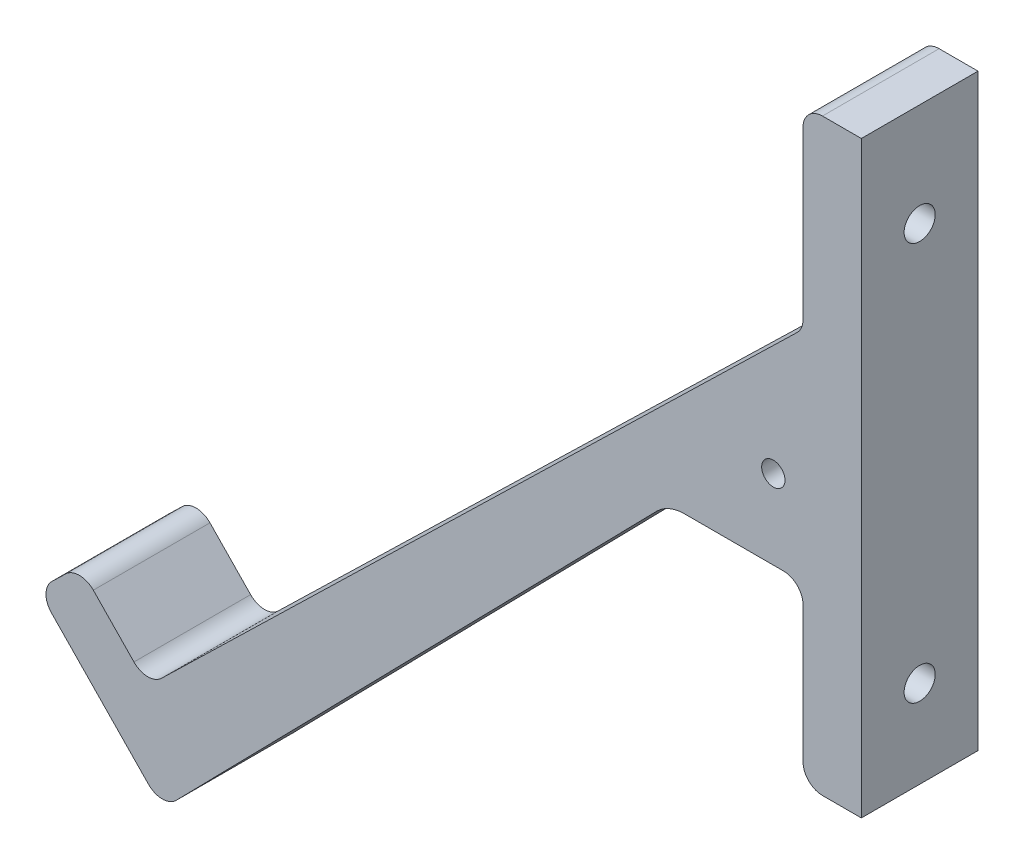
ISO-10303-21;
HEADER;
FILE_DESCRIPTION(('STEP AP214'),'2;1');
FILE_NAME('part.step','',(''),(''),'','','');
FILE_SCHEMA(('AUTOMOTIVE_DESIGN { 1 0 10303 214 1 1 1 1 }'));
ENDSEC;
DATA;
#1=APPLICATION_CONTEXT('core data for automotive mechanical design processes');
#2=APPLICATION_PROTOCOL_DEFINITION('international standard','automotive_design',2000,#1);
#3=PRODUCT_CONTEXT('',#1,'mechanical');
#4=PRODUCT('Part','Part','',(#3));
#5=PRODUCT_RELATED_PRODUCT_CATEGORY('part','',(#4));
#6=PRODUCT_DEFINITION_FORMATION('','',#4);
#7=PRODUCT_DEFINITION_CONTEXT('part definition',#1,'design');
#8=PRODUCT_DEFINITION('design','',#6,#7);
#9=PRODUCT_DEFINITION_SHAPE('','',#8);
#10=(LENGTH_UNIT() NAMED_UNIT(*) SI_UNIT(.MILLI.,.METRE.));
#11=(NAMED_UNIT(*) PLANE_ANGLE_UNIT() SI_UNIT($,.RADIAN.));
#12=(NAMED_UNIT(*) SI_UNIT($,.STERADIAN.) SOLID_ANGLE_UNIT());
#13=UNCERTAINTY_MEASURE_WITH_UNIT(LENGTH_MEASURE(1.E-05),#10,'distance_accuracy_value','');
#14=(GEOMETRIC_REPRESENTATION_CONTEXT(3) GLOBAL_UNCERTAINTY_ASSIGNED_CONTEXT((#13)) GLOBAL_UNIT_ASSIGNED_CONTEXT((#10,
#11,#12)) REPRESENTATION_CONTEXT('',''));
#15=CARTESIAN_POINT('',(0.,0.,0.));
#16=DIRECTION('',(0.,0.,1.));
#17=DIRECTION('',(1.,0.,0.));
#18=AXIS2_PLACEMENT_3D('',#15,#16,#17);
#19=CARTESIAN_POINT('',(9.99999999999997,-56.3423168679851,30.));
#20=DIRECTION('',(0.,1.,0.));
#21=DIRECTION('',(-1.,0.,0.));
#22=AXIS2_PLACEMENT_3D('',#19,#20,#21);
#23=PLANE('',#22);
#24=DIRECTION('',(1.,0.,0.));
#25=VECTOR('',#24,1.);
#26=CARTESIAN_POINT('',(9.99999999999997,-56.3423168679851,0.));
#27=LINE('',#26,#25);
#28=CARTESIAN_POINT('',(-30.4960170213361,-56.342316867985,0.));
#29=VERTEX_POINT('',#28);
#30=CARTESIAN_POINT('',(-4.99999999999998,-56.3423168679851,0.));
#31=VERTEX_POINT('',#30);
#32=EDGE_CURVE('E277',#29,#31,#27,.T.);
#33=ORIENTED_EDGE('',*,*,#32,.T.);
#34=DIRECTION('',(0.,0.,-1.));
#35=VECTOR('',#34,1.);
#36=CARTESIAN_POINT('',(-4.99999999999998,-56.3423168679851,30.));
#37=LINE('',#36,#35);
#38=CARTESIAN_POINT('',(-4.99999999999998,-56.3423168679851,30.));
#39=VERTEX_POINT('',#38);
#40=EDGE_CURVE('E59',#31,#39,#37,.F.);
#41=ORIENTED_EDGE('',*,*,#40,.T.);
#42=DIRECTION('',(1.,0.,0.));
#43=VECTOR('',#42,1.);
#44=CARTESIAN_POINT('',(9.99999999999997,-56.3423168679851,30.));
#45=LINE('',#44,#43);
#46=CARTESIAN_POINT('',(-30.4960170213361,-56.342316867985,30.));
#47=VERTEX_POINT('',#46);
#48=EDGE_CURVE('E207',#47,#39,#45,.T.);
#49=ORIENTED_EDGE('',*,*,#48,.F.);
#50=DIRECTION('',(0.,0.,-1.));
#51=VECTOR('',#50,1.);
#52=CARTESIAN_POINT('',(-30.4960170213361,-56.342316867985,30.));
#53=LINE('',#52,#51);
#54=EDGE_CURVE('E354',#47,#29,#53,.T.);
#55=ORIENTED_EDGE('',*,*,#54,.T.);
#56=EDGE_LOOP('',(#33,#41,#49,#55));
#57=FACE_BOUND('',#56,.T.);
#58=ADVANCED_FACE('F43',(#57),#23,.F.);
#59=CARTESIAN_POINT('',(-179.347269349611,-174.168185891793,30.));
#60=DIRECTION('',(0.717389077398442,0.696672743567173,0.));
#61=DIRECTION('',(-0.696672743567173,0.717389077398442,0.));
#62=AXIS2_PLACEMENT_3D('',#59,#60,#61);
#63=PLANE('',#62);
#64=DIRECTION('',(0.696672743567173,-0.717389077398442,0.));
#65=VECTOR('',#64,1.);
#66=CARTESIAN_POINT('',(-179.347269349611,-174.168185891793,0.));
#67=LINE('',#66,#65);
#68=CARTESIAN_POINT('',(-193.284026826992,-159.817003531147,0.));
#69=VERTEX_POINT('',#68);
#70=CARTESIAN_POINT('',(-168.352304294731,-185.490098381668,0.));
#71=VERTEX_POINT('',#70);
#72=EDGE_CURVE('E214',#69,#71,#67,.T.);
#73=ORIENTED_EDGE('',*,*,#72,.T.);
#74=DIRECTION('',(0.,0.,-1.));
#75=VECTOR('',#74,1.);
#76=CARTESIAN_POINT('',(-168.352304294731,-185.490098381668,30.));
#77=LINE('',#76,#75);
#78=CARTESIAN_POINT('',(-168.352304294731,-185.490098381668,30.));
#79=VERTEX_POINT('',#78);
#80=EDGE_CURVE('E366',#79,#71,#77,.T.);
#81=ORIENTED_EDGE('',*,*,#80,.F.);
#82=DIRECTION('',(0.696672743567173,-0.717389077398442,0.));
#83=VECTOR('',#82,1.);
#84=CARTESIAN_POINT('',(-179.347269349611,-174.168185891793,30.));
#85=LINE('',#84,#83);
#86=CARTESIAN_POINT('',(-193.284026826992,-159.817003531147,30.));
#87=VERTEX_POINT('',#86);
#88=EDGE_CURVE('E225',#87,#79,#85,.T.);
#89=ORIENTED_EDGE('',*,*,#88,.F.);
#90=DIRECTION('',(0.,0.,-1.));
#91=VECTOR('',#90,1.);
#92=CARTESIAN_POINT('',(-193.284026826992,-159.817003531147,30.));
#93=LINE('',#92,#91);
#94=EDGE_CURVE('E267',#87,#69,#93,.T.);
#95=ORIENTED_EDGE('',*,*,#94,.T.);
#96=EDGE_LOOP('',(#73,#81,#89,#95));
#97=FACE_BOUND('',#96,.T.);
#98=ADVANCED_FACE('F419',(#97),#63,.F.);
#99=CARTESIAN_POINT('',(-164.765358907738,-182.006734663832,30.));
#100=DIRECTION('',(0.,0.,-1.));
#101=DIRECTION('',(-1.,0.,0.));
#102=AXIS2_PLACEMENT_3D('',#99,#100,#101);
#103=CYLINDRICAL_SURFACE('',#102,5.00000000000001);
#104=CARTESIAN_POINT('',(-164.765358907738,-182.006734663832,0.));
#105=DIRECTION('',(0.,0.,1.));
#106=DIRECTION('',(1.,0.,0.));
#107=AXIS2_PLACEMENT_3D('',#104,#105,#106);
#108=CIRCLE('',#107,5.00000000000001);
#109=CARTESIAN_POINT('',(-161.193106920874,-185.505165132248,0.));
#110=VERTEX_POINT('',#109);
#111=EDGE_CURVE('E220',#71,#110,#108,.T.);
#112=ORIENTED_EDGE('',*,*,#111,.T.);
#113=DIRECTION('',(0.,0.,-1.));
#114=VECTOR('',#113,1.);
#115=CARTESIAN_POINT('',(-161.193106920874,-185.505165132248,30.));
#116=LINE('',#115,#114);
#117=CARTESIAN_POINT('',(-161.193106920874,-185.505165132248,30.));
#118=VERTEX_POINT('',#117);
#119=EDGE_CURVE('E362',#118,#110,#116,.T.);
#120=ORIENTED_EDGE('',*,*,#119,.F.);
#121=CARTESIAN_POINT('',(-164.765358907738,-182.006734663832,30.));
#122=DIRECTION('',(0.,0.,1.));
#123=DIRECTION('',(1.,0.,0.));
#124=AXIS2_PLACEMENT_3D('',#121,#122,#123);
#125=CIRCLE('',#124,5.00000000000001);
#126=EDGE_CURVE('E228',#79,#118,#125,.T.);
#127=ORIENTED_EDGE('',*,*,#126,.F.);
#128=ORIENTED_EDGE('',*,*,#80,.T.);
#129=EDGE_LOOP('',(#112,#120,#127,#128));
#130=FACE_BOUND('',#129,.T.);
#131=ADVANCED_FACE('F424',(#130),#103,.T.);
#132=CARTESIAN_POINT('',(-161.193106920874,-185.505165132248,30.));
#133=DIRECTION('',(-0.714450397372837,0.6996860936833,0.));
#134=DIRECTION('',(-0.6996860936833,-0.714450397372837,0.));
#135=AXIS2_PLACEMENT_3D('',#132,#133,#134);
#136=PLANE('',#135);
#137=DIRECTION('',(0.6996860936833,0.714450397372837,0.));
#138=VECTOR('',#137,1.);
#139=CARTESIAN_POINT('',(-161.193106920874,-185.505165132248,0.));
#140=LINE('',#139,#138);
#141=CARTESIAN_POINT('',(-37.6405209950646,-59.3454559311521,0.));
#142=VERTEX_POINT('',#141);
#143=EDGE_CURVE('E271',#110,#142,#140,.T.);
#144=ORIENTED_EDGE('',*,*,#143,.T.);
#145=DIRECTION('',(0.,0.,-1.));
#146=VECTOR('',#145,1.);
#147=CARTESIAN_POINT('',(-37.6405209950646,-59.3454559311521,30.));
#148=LINE('',#147,#146);
#149=CARTESIAN_POINT('',(-37.6405209950646,-59.3454559311521,30.));
#150=VERTEX_POINT('',#149);
#151=EDGE_CURVE('E358',#150,#142,#148,.T.);
#152=ORIENTED_EDGE('',*,*,#151,.F.);
#153=DIRECTION('',(0.6996860936833,0.714450397372837,0.));
#154=VECTOR('',#153,1.);
#155=CARTESIAN_POINT('',(-161.193106920874,-185.505165132248,30.));
#156=LINE('',#155,#154);
#157=EDGE_CURVE('E232',#118,#150,#156,.T.);
#158=ORIENTED_EDGE('',*,*,#157,.F.);
#159=ORIENTED_EDGE('',*,*,#119,.T.);
#160=EDGE_LOOP('',(#144,#152,#158,#159));
#161=FACE_BOUND('',#160,.T.);
#162=ADVANCED_FACE('F433',(#161),#136,.F.);
#163=CARTESIAN_POINT('',(-30.4960170213362,-66.342316867985,30.));
#164=DIRECTION('',(0.,0.,-1.));
#165=DIRECTION('',(-1.,0.,0.));
#166=AXIS2_PLACEMENT_3D('',#163,#164,#165);
#167=CYLINDRICAL_SURFACE('',#166,10.);
#168=CARTESIAN_POINT('',(-30.4960170213362,-66.342316867985,0.));
#169=DIRECTION('',(0.,0.,-1.));
#170=DIRECTION('',(1.,0.,0.));
#171=AXIS2_PLACEMENT_3D('',#168,#169,#170);
#172=CIRCLE('',#171,10.);
#173=EDGE_CURVE('E274',#142,#29,#172,.T.);
#174=ORIENTED_EDGE('',*,*,#173,.T.);
#175=ORIENTED_EDGE('',*,*,#54,.F.);
#176=CARTESIAN_POINT('',(-30.4960170213362,-66.342316867985,30.));
#177=DIRECTION('',(0.,0.,-1.));
#178=DIRECTION('',(1.,0.,0.));
#179=AXIS2_PLACEMENT_3D('',#176,#177,#178);
#180=CIRCLE('',#179,10.);
#181=EDGE_CURVE('E235',#150,#47,#180,.T.);
#182=ORIENTED_EDGE('',*,*,#181,.F.);
#183=ORIENTED_EDGE('',*,*,#151,.T.);
#184=EDGE_LOOP('',(#174,#175,#182,#183));
#185=FACE_BOUND('',#184,.T.);
#186=ADVANCED_FACE('F430',(#185),#167,.F.);
#187=CARTESIAN_POINT('',(15.,50.,30.));
#188=DIRECTION('',(-1.,0.,0.));
#189=DIRECTION('',(0.,0.,1.));
#190=AXIS2_PLACEMENT_3D('',#187,#188,#189);
#191=PLANE('',#190);
#192=CARTESIAN_POINT('',(15.,-78.842316867985,15.));
#193=DIRECTION('',(-1.,0.,0.));
#194=DIRECTION('',(0.,0.,1.));
#195=AXIS2_PLACEMENT_3D('',#192,#193,#194);
#196=CIRCLE('',#195,4.);
#197=CARTESIAN_POINT('',(15.,-78.842316867985,19.));
#198=VERTEX_POINT('',#197);
#199=EDGE_CURVE('E471',#198,#198,#196,.T.);
#200=ORIENTED_EDGE('',*,*,#199,.T.);
#201=EDGE_LOOP('',(#200));
#202=FACE_BOUND('',#201,.T.);
#203=CARTESIAN_POINT('',(15.,23.5570528113308,15.));
#204=DIRECTION('',(-1.,0.,0.));
#205=DIRECTION('',(0.,0.,1.));
#206=AXIS2_PLACEMENT_3D('',#203,#204,#205);
#207=CIRCLE('',#206,4.);
#208=CARTESIAN_POINT('',(15.,23.5570528113308,19.));
#209=VERTEX_POINT('',#208);
#210=EDGE_CURVE('E464',#209,#209,#207,.T.);
#211=ORIENTED_EDGE('',*,*,#210,.T.);
#212=EDGE_LOOP('',(#211));
#213=FACE_BOUND('',#212,.T.);
#214=DIRECTION('',(0.,1.,0.));
#215=VECTOR('',#214,1.);
#216=CARTESIAN_POINT('',(15.,50.,0.));
#217=LINE('',#216,#215);
#218=CARTESIAN_POINT('',(15.,-101.342316867985,0.));
#219=VERTEX_POINT('',#218);
#220=CARTESIAN_POINT('',(15.,50.,0.));
#221=VERTEX_POINT('',#220);
#222=EDGE_CURVE('E280',#219,#221,#217,.T.);
#223=ORIENTED_EDGE('',*,*,#222,.T.);
#224=DIRECTION('',(0.,0.,-1.));
#225=VECTOR('',#224,1.);
#226=CARTESIAN_POINT('',(15.,50.,30.));
#227=LINE('',#226,#225);
#228=CARTESIAN_POINT('',(15.,50.,30.));
#229=VERTEX_POINT('',#228);
#230=EDGE_CURVE('E203',#229,#221,#227,.T.);
#231=ORIENTED_EDGE('',*,*,#230,.F.);
#232=DIRECTION('',(0.,1.,0.));
#233=VECTOR('',#232,1.);
#234=CARTESIAN_POINT('',(15.,-6.34231686798508,30.));
#235=LINE('',#234,#233);
#236=CARTESIAN_POINT('',(15.,-101.342316867985,30.));
#237=VERTEX_POINT('',#236);
#238=EDGE_CURVE('E187',#237,#229,#235,.T.);
#239=ORIENTED_EDGE('',*,*,#238,.F.);
#240=DIRECTION('',(0.,0.,-1.));
#241=VECTOR('',#240,1.);
#242=CARTESIAN_POINT('',(15.,-101.342316867985,30.));
#243=LINE('',#242,#241);
#244=EDGE_CURVE('E196',#237,#219,#243,.T.);
#245=ORIENTED_EDGE('',*,*,#244,.T.);
#246=EDGE_LOOP('',(#223,#231,#239,#245));
#247=FACE_BOUND('',#246,.T.);
#248=ADVANCED_FACE('F201',(#202,#213,#247),#191,.F.);
#249=CARTESIAN_POINT('',(5.00000000000004,50.,30.));
#250=DIRECTION('',(0.,-1.,0.));
#251=DIRECTION('',(0.,0.,-1.));
#252=AXIS2_PLACEMENT_3D('',#249,#250,#251);
#253=PLANE('',#252);
#254=DIRECTION('',(-1.,0.,0.));
#255=VECTOR('',#254,1.);
#256=CARTESIAN_POINT('',(5.00000000000004,50.,0.));
#257=LINE('',#256,#255);
#258=CARTESIAN_POINT('',(5.00000000000004,50.,0.));
#259=VERTEX_POINT('',#258);
#260=EDGE_CURVE('E283',#221,#259,#257,.T.);
#261=ORIENTED_EDGE('',*,*,#260,.T.);
#262=DIRECTION('',(0.,0.,-1.));
#263=VECTOR('',#262,1.);
#264=CARTESIAN_POINT('',(5.00000000000004,50.,30.));
#265=LINE('',#264,#263);
#266=CARTESIAN_POINT('',(5.00000000000004,50.,30.));
#267=VERTEX_POINT('',#266);
#268=EDGE_CURVE('E348',#267,#259,#265,.T.);
#269=ORIENTED_EDGE('',*,*,#268,.F.);
#270=DIRECTION('',(-1.,0.,0.));
#271=VECTOR('',#270,1.);
#272=CARTESIAN_POINT('',(5.00000000000004,50.,30.));
#273=LINE('',#272,#271);
#274=EDGE_CURVE('E206',#229,#267,#273,.T.);
#275=ORIENTED_EDGE('',*,*,#274,.F.);
#276=ORIENTED_EDGE('',*,*,#230,.T.);
#277=EDGE_LOOP('',(#261,#269,#275,#276));
#278=FACE_BOUND('',#277,.T.);
#279=ADVANCED_FACE('F536',(#278),#253,.F.);
#280=CARTESIAN_POINT('',(5.,45.,30.));
#281=DIRECTION('',(0.,0.,-1.));
#282=DIRECTION('',(-1.,0.,0.));
#283=AXIS2_PLACEMENT_3D('',#280,#281,#282);
#284=CYLINDRICAL_SURFACE('',#283,5.);
#285=CARTESIAN_POINT('',(5.,45.,0.));
#286=DIRECTION('',(0.,0.,1.));
#287=DIRECTION('',(-1.,0.,0.));
#288=AXIS2_PLACEMENT_3D('',#285,#286,#287);
#289=CIRCLE('',#288,5.);
#290=CARTESIAN_POINT('',(0.,45.,0.));
#291=VERTEX_POINT('',#290);
#292=EDGE_CURVE('E286',#259,#291,#289,.T.);
#293=ORIENTED_EDGE('',*,*,#292,.T.);
#294=DIRECTION('',(0.,0.,-1.));
#295=VECTOR('',#294,1.);
#296=CARTESIAN_POINT('',(0.,45.,30.));
#297=LINE('',#296,#295);
#298=CARTESIAN_POINT('',(0.,45.,30.));
#299=VERTEX_POINT('',#298);
#300=EDGE_CURVE('E344',#299,#291,#297,.T.);
#301=ORIENTED_EDGE('',*,*,#300,.F.);
#302=CARTESIAN_POINT('',(5.,45.,30.));
#303=DIRECTION('',(0.,0.,1.));
#304=DIRECTION('',(-1.,0.,0.));
#305=AXIS2_PLACEMENT_3D('',#302,#303,#304);
#306=CIRCLE('',#305,5.);
#307=EDGE_CURVE('E242',#267,#299,#306,.T.);
#308=ORIENTED_EDGE('',*,*,#307,.F.);
#309=ORIENTED_EDGE('',*,*,#268,.T.);
#310=EDGE_LOOP('',(#293,#301,#308,#309));
#311=FACE_BOUND('',#310,.T.);
#312=ADVANCED_FACE('F533',(#311),#284,.T.);
#313=CARTESIAN_POINT('',(0.,2.11410562266172,30.));
#314=DIRECTION('',(1.,0.,0.));
#315=DIRECTION('',(0.,0.,-1.));
#316=AXIS2_PLACEMENT_3D('',#313,#314,#315);
#317=PLANE('',#316);
#318=CARTESIAN_POINT('',(0.,23.5570528113308,15.));
#319=DIRECTION('',(1.,0.,0.));
#320=DIRECTION('',(0.,0.,-1.));
#321=AXIS2_PLACEMENT_3D('',#318,#319,#320);
#322=CIRCLE('',#321,4.5);
#323=CARTESIAN_POINT('',(0.,23.5570528113308,10.5));
#324=VERTEX_POINT('',#323);
#325=EDGE_CURVE('E395',#324,#324,#322,.T.);
#326=ORIENTED_EDGE('',*,*,#325,.T.);
#327=EDGE_LOOP('',(#326));
#328=FACE_BOUND('',#327,.T.);
#329=DIRECTION('',(0.,-1.,0.));
#330=VECTOR('',#329,1.);
#331=CARTESIAN_POINT('',(0.,2.11410562266172,0.));
#332=LINE('',#331,#330);
#333=CARTESIAN_POINT('',(0.,2.11410562266172,0.));
#334=VERTEX_POINT('',#333);
#335=EDGE_CURVE('E289',#291,#334,#332,.T.);
#336=ORIENTED_EDGE('',*,*,#335,.T.);
#337=DIRECTION('',(0.,0.,-1.));
#338=VECTOR('',#337,1.);
#339=CARTESIAN_POINT('',(0.,2.11410562266172,30.));
#340=LINE('',#339,#338);
#341=CARTESIAN_POINT('',(0.,2.11410562266172,30.));
#342=VERTEX_POINT('',#341);
#343=EDGE_CURVE('E340',#342,#334,#340,.T.);
#344=ORIENTED_EDGE('',*,*,#343,.F.);
#345=DIRECTION('',(0.,-1.,0.));
#346=VECTOR('',#345,1.);
#347=CARTESIAN_POINT('',(0.,2.11410562266172,30.));
#348=LINE('',#347,#346);
#349=EDGE_CURVE('E245',#299,#342,#348,.T.);
#350=ORIENTED_EDGE('',*,*,#349,.F.);
#351=ORIENTED_EDGE('',*,*,#300,.T.);
#352=EDGE_LOOP('',(#336,#344,#350,#351));
#353=FACE_BOUND('',#352,.T.);
#354=ADVANCED_FACE('F529',(#328,#353),#317,.F.);
#355=CARTESIAN_POINT('',(-5.,2.1141056226617,30.));
#356=DIRECTION('',(0.,0.,-1.));
#357=DIRECTION('',(-1.,0.,0.));
#358=AXIS2_PLACEMENT_3D('',#355,#356,#357);
#359=CYLINDRICAL_SURFACE('',#358,5.);
#360=CARTESIAN_POINT('',(-5.,2.1141056226617,0.));
#361=DIRECTION('',(0.,0.,-1.));
#362=DIRECTION('',(1.,0.,0.));
#363=AXIS2_PLACEMENT_3D('',#360,#361,#362);
#364=CIRCLE('',#363,5.);
#365=CARTESIAN_POINT('',(-1.51663628216415,-1.47283976433053,0.));
#366=VERTEX_POINT('',#365);
#367=EDGE_CURVE('E292',#334,#366,#364,.T.);
#368=ORIENTED_EDGE('',*,*,#367,.T.);
#369=DIRECTION('',(0.,0.,-1.));
#370=VECTOR('',#369,1.);
#371=CARTESIAN_POINT('',(-1.51663628216415,-1.47283976433053,30.));
#372=LINE('',#371,#370);
#373=CARTESIAN_POINT('',(-1.51663628216415,-1.47283976433053,30.));
#374=VERTEX_POINT('',#373);
#375=EDGE_CURVE('E336',#374,#366,#372,.T.);
#376=ORIENTED_EDGE('',*,*,#375,.F.);
#377=CARTESIAN_POINT('',(-5.,2.1141056226617,30.));
#378=DIRECTION('',(0.,0.,-1.));
#379=DIRECTION('',(1.,0.,0.));
#380=AXIS2_PLACEMENT_3D('',#377,#378,#379);
#381=CIRCLE('',#380,5.);
#382=EDGE_CURVE('E248',#342,#374,#381,.T.);
#383=ORIENTED_EDGE('',*,*,#382,.F.);
#384=ORIENTED_EDGE('',*,*,#343,.T.);
#385=EDGE_LOOP('',(#368,#376,#383,#384));
#386=FACE_BOUND('',#385,.T.);
#387=ADVANCED_FACE('F525',(#386),#359,.F.);
#388=CARTESIAN_POINT('',(-1.51663628216415,-1.47283976433053,30.));
#389=DIRECTION('',(0.696672743567173,-0.717389077398442,0.));
#390=DIRECTION('',(0.717389077398442,0.696672743567173,0.));
#391=AXIS2_PLACEMENT_3D('',#388,#389,#390);
#392=PLANE('',#391);
#393=DIRECTION('',(-0.717389077398442,-0.696672743567173,0.));
#394=VECTOR('',#393,1.);
#395=CARTESIAN_POINT('',(-1.51663628216415,-1.47283976433053,0.));
#396=LINE('',#395,#394);
#397=CARTESIAN_POINT('',(-164.999487801642,-160.23473102045,0.));
#398=VERTEX_POINT('',#397);
#399=EDGE_CURVE('E295',#366,#398,#396,.T.);
#400=ORIENTED_EDGE('',*,*,#399,.T.);
#401=DIRECTION('',(0.,0.,-1.));
#402=VECTOR('',#401,1.);
#403=CARTESIAN_POINT('',(-164.999487801642,-160.23473102045,30.));
#404=LINE('',#403,#402);
#405=CARTESIAN_POINT('',(-164.999487801642,-160.23473102045,30.));
#406=VERTEX_POINT('',#405);
#407=EDGE_CURVE('E332',#406,#398,#404,.T.);
#408=ORIENTED_EDGE('',*,*,#407,.F.);
#409=DIRECTION('',(-0.717389077398442,-0.696672743567173,0.));
#410=VECTOR('',#409,1.);
#411=CARTESIAN_POINT('',(-1.51663628216415,-1.47283976433053,30.));
#412=LINE('',#411,#410);
#413=EDGE_CURVE('E250',#374,#406,#412,.T.);
#414=ORIENTED_EDGE('',*,*,#413,.F.);
#415=ORIENTED_EDGE('',*,*,#375,.T.);
#416=EDGE_LOOP('',(#400,#408,#414,#415));
#417=FACE_BOUND('',#416,.T.);
#418=ADVANCED_FACE('F521',(#417),#392,.F.);
#419=CARTESIAN_POINT('',(-168.482851519477,-156.647785633458,30.));
#420=DIRECTION('',(0.,0.,-1.));
#421=DIRECTION('',(-1.,0.,0.));
#422=AXIS2_PLACEMENT_3D('',#419,#420,#421);
#423=CYLINDRICAL_SURFACE('',#422,5.);
#424=CARTESIAN_POINT('',(-168.482851519477,-156.647785633458,0.));
#425=DIRECTION('',(0.,0.,-1.));
#426=DIRECTION('',(1.,0.,0.));
#427=AXIS2_PLACEMENT_3D('',#424,#425,#426);
#428=CIRCLE('',#427,5.);
#429=CARTESIAN_POINT('',(-172.06979690647,-160.131149351293,0.));
#430=VERTEX_POINT('',#429);
#431=EDGE_CURVE('E298',#398,#430,#428,.T.);
#432=ORIENTED_EDGE('',*,*,#431,.T.);
#433=DIRECTION('',(0.,0.,-1.));
#434=VECTOR('',#433,1.);
#435=CARTESIAN_POINT('',(-172.06979690647,-160.131149351293,30.));
#436=LINE('',#435,#434);
#437=CARTESIAN_POINT('',(-172.06979690647,-160.131149351293,30.));
#438=VERTEX_POINT('',#437);
#439=EDGE_CURVE('E328',#438,#430,#436,.T.);
#440=ORIENTED_EDGE('',*,*,#439,.F.);
#441=CARTESIAN_POINT('',(-168.482851519477,-156.647785633458,30.));
#442=DIRECTION('',(0.,0.,-1.));
#443=DIRECTION('',(1.,0.,0.));
#444=AXIS2_PLACEMENT_3D('',#441,#442,#443);
#445=CIRCLE('',#444,5.);
#446=EDGE_CURVE('E253',#406,#438,#445,.T.);
#447=ORIENTED_EDGE('',*,*,#446,.F.);
#448=ORIENTED_EDGE('',*,*,#407,.T.);
#449=EDGE_LOOP('',(#432,#440,#447,#448));
#450=FACE_BOUND('',#449,.T.);
#451=ADVANCED_FACE('F517',(#450),#423,.F.);
#452=CARTESIAN_POINT('',(-182.523190666015,-149.366912377639,30.));
#453=DIRECTION('',(-0.717389077398442,-0.696672743567173,0.));
#454=DIRECTION('',(0.696672743567173,-0.717389077398442,0.));
#455=AXIS2_PLACEMENT_3D('',#452,#453,#454);
#456=PLANE('',#455);
#457=DIRECTION('',(-0.696672743567173,0.717389077398442,0.));
#458=VECTOR('',#457,1.);
#459=CARTESIAN_POINT('',(-182.523190666015,-149.366912377639,0.));
#460=LINE('',#459,#458);
#461=CARTESIAN_POINT('',(-182.523190666015,-149.366912377639,0.));
#462=VERTEX_POINT('',#461);
#463=EDGE_CURVE('E301',#430,#462,#460,.T.);
#464=ORIENTED_EDGE('',*,*,#463,.T.);
#465=DIRECTION('',(0.,0.,-1.));
#466=VECTOR('',#465,1.);
#467=CARTESIAN_POINT('',(-182.523190666015,-149.366912377639,30.));
#468=LINE('',#467,#466);
#469=CARTESIAN_POINT('',(-182.523190666015,-149.366912377639,30.));
#470=VERTEX_POINT('',#469);
#471=EDGE_CURVE('E324',#470,#462,#468,.T.);
#472=ORIENTED_EDGE('',*,*,#471,.F.);
#473=DIRECTION('',(-0.696672743567173,0.717389077398442,0.));
#474=VECTOR('',#473,1.);
#475=CARTESIAN_POINT('',(-182.523190666015,-149.366912377639,30.));
#476=LINE('',#475,#474);
#477=EDGE_CURVE('E256',#438,#470,#476,.T.);
#478=ORIENTED_EDGE('',*,*,#477,.F.);
#479=ORIENTED_EDGE('',*,*,#439,.T.);
#480=EDGE_LOOP('',(#464,#472,#478,#479));
#481=FACE_BOUND('',#480,.T.);
#482=ADVANCED_FACE('F513',(#481),#456,.F.);
#483=CARTESIAN_POINT('',(-186.110136053007,-152.850276095475,30.));
#484=DIRECTION('',(0.,0.,-1.));
#485=DIRECTION('',(-1.,0.,0.));
#486=AXIS2_PLACEMENT_3D('',#483,#484,#485);
#487=CYLINDRICAL_SURFACE('',#486,5.00000000000003);
#488=CARTESIAN_POINT('',(-186.110136053007,-152.850276095475,0.));
#489=DIRECTION('',(0.,0.,1.));
#490=DIRECTION('',(-1.,0.,0.));
#491=AXIS2_PLACEMENT_3D('',#488,#489,#490);
#492=CIRCLE('',#491,5.00000000000003);
#493=CARTESIAN_POINT('',(-189.593499770843,-149.263330708483,0.));
#494=VERTEX_POINT('',#493);
#495=EDGE_CURVE('E304',#462,#494,#492,.T.);
#496=ORIENTED_EDGE('',*,*,#495,.T.);
#497=DIRECTION('',(0.,0.,-1.));
#498=VECTOR('',#497,1.);
#499=CARTESIAN_POINT('',(-189.593499770843,-149.263330708483,30.));
#500=LINE('',#499,#498);
#501=CARTESIAN_POINT('',(-189.593499770843,-149.263330708483,30.));
#502=VERTEX_POINT('',#501);
#503=EDGE_CURVE('E320',#502,#494,#500,.T.);
#504=ORIENTED_EDGE('',*,*,#503,.F.);
#505=CARTESIAN_POINT('',(-186.110136053007,-152.850276095475,30.));
#506=DIRECTION('',(0.,0.,1.));
#507=DIRECTION('',(-1.,0.,0.));
#508=AXIS2_PLACEMENT_3D('',#505,#506,#507);
#509=CIRCLE('',#508,5.00000000000003);
#510=EDGE_CURVE('E259',#470,#502,#509,.T.);
#511=ORIENTED_EDGE('',*,*,#510,.F.);
#512=ORIENTED_EDGE('',*,*,#471,.T.);
#513=EDGE_LOOP('',(#496,#504,#511,#512));
#514=FACE_BOUND('',#513,.T.);
#515=ADVANCED_FACE('F509',(#514),#487,.T.);
#516=CARTESIAN_POINT('',(-193.180445157835,-152.746694426319,30.));
#517=DIRECTION('',(0.696672743567174,-0.717389077398441,0.));
#518=DIRECTION('',(0.717389077398441,0.696672743567174,0.));
#519=AXIS2_PLACEMENT_3D('',#516,#517,#518);
#520=PLANE('',#519);
#521=DIRECTION('',(-0.717389077398441,-0.696672743567174,0.));
#522=VECTOR('',#521,1.);
#523=CARTESIAN_POINT('',(-193.180445157835,-152.746694426319,0.));
#524=LINE('',#523,#522);
#525=CARTESIAN_POINT('',(-193.180445157835,-152.746694426319,0.));
#526=VERTEX_POINT('',#525);
#527=EDGE_CURVE('E307',#494,#526,#524,.T.);
#528=ORIENTED_EDGE('',*,*,#527,.T.);
#529=DIRECTION('',(0.,0.,-1.));
#530=VECTOR('',#529,1.);
#531=CARTESIAN_POINT('',(-193.180445157835,-152.746694426319,30.));
#532=LINE('',#531,#530);
#533=CARTESIAN_POINT('',(-193.180445157835,-152.746694426319,30.));
#534=VERTEX_POINT('',#533);
#535=EDGE_CURVE('E316',#534,#526,#532,.T.);
#536=ORIENTED_EDGE('',*,*,#535,.F.);
#537=DIRECTION('',(-0.717389077398441,-0.696672743567174,0.));
#538=VECTOR('',#537,1.);
#539=CARTESIAN_POINT('',(-193.180445157835,-152.746694426319,30.));
#540=LINE('',#539,#538);
#541=EDGE_CURVE('E262',#502,#534,#540,.T.);
#542=ORIENTED_EDGE('',*,*,#541,.F.);
#543=ORIENTED_EDGE('',*,*,#503,.T.);
#544=EDGE_LOOP('',(#528,#536,#542,#543));
#545=FACE_BOUND('',#544,.T.);
#546=ADVANCED_FACE('F501',(#545),#520,.F.);
#547=CARTESIAN_POINT('',(-189.69708144,-156.333639813311,30.));
#548=DIRECTION('',(0.,0.,-1.));
#549=DIRECTION('',(-1.,0.,0.));
#550=AXIS2_PLACEMENT_3D('',#547,#548,#549);
#551=CYLINDRICAL_SURFACE('',#550,5.00000000000002);
#552=CARTESIAN_POINT('',(-189.69708144,-156.333639813311,0.));
#553=DIRECTION('',(0.,0.,1.));
#554=DIRECTION('',(-1.,0.,0.));
#555=AXIS2_PLACEMENT_3D('',#552,#553,#554);
#556=CIRCLE('',#555,5.00000000000002);
#557=EDGE_CURVE('E229',#526,#69,#556,.T.);
#558=ORIENTED_EDGE('',*,*,#557,.T.);
#559=ORIENTED_EDGE('',*,*,#94,.F.);
#560=CARTESIAN_POINT('',(-189.69708144,-156.333639813311,30.));
#561=DIRECTION('',(0.,0.,1.));
#562=DIRECTION('',(-1.,0.,0.));
#563=AXIS2_PLACEMENT_3D('',#560,#561,#562);
#564=CIRCLE('',#563,5.00000000000002);
#565=EDGE_CURVE('E265',#534,#87,#564,.T.);
#566=ORIENTED_EDGE('',*,*,#565,.F.);
#567=ORIENTED_EDGE('',*,*,#535,.T.);
#568=EDGE_LOOP('',(#558,#559,#566,#567));
#569=FACE_BOUND('',#568,.T.);
#570=ADVANCED_FACE('F493',(#569),#551,.T.);
#571=CARTESIAN_POINT('',(-189.69708144,-156.333639813311,30.));
#572=DIRECTION('',(0.,0.,-1.));
#573=DIRECTION('',(-1.,0.,0.));
#574=AXIS2_PLACEMENT_3D('',#571,#572,#573);
#575=PLANE('',#574);
#576=CARTESIAN_POINT('',(-7.63717374163167,-35.9568868399907,30.));
#577=DIRECTION('',(0.,0.,1.));
#578=DIRECTION('',(1.,0.,0.));
#579=AXIS2_PLACEMENT_3D('',#576,#577,#578);
#580=CIRCLE('',#579,3.);
#581=CARTESIAN_POINT('',(-4.63717374163167,-35.9568868399907,30.));
#582=VERTEX_POINT('',#581);
#583=EDGE_CURVE('E482',#582,#582,#580,.T.);
#584=ORIENTED_EDGE('',*,*,#583,.F.);
#585=EDGE_LOOP('',(#584));
#586=FACE_BOUND('',#585,.T.);
#587=DIRECTION('',(0.,-1.,0.));
#588=VECTOR('',#587,1.);
#589=CARTESIAN_POINT('',(0.,-51.342316867985,30.));
#590=LINE('',#589,#588);
#591=CARTESIAN_POINT('',(0.,-61.3423168679851,30.));
#592=VERTEX_POINT('',#591);
#593=CARTESIAN_POINT('',(0.,-96.342316867985,30.));
#594=VERTEX_POINT('',#593);
#595=EDGE_CURVE('E197',#592,#594,#590,.T.);
#596=ORIENTED_EDGE('',*,*,#595,.T.);
#597=CARTESIAN_POINT('',(5.00000000000002,-96.342316867985,30.));
#598=DIRECTION('',(0.,0.,-1.));
#599=DIRECTION('',(-1.,0.,0.));
#600=AXIS2_PLACEMENT_3D('',#597,#598,#599);
#601=CIRCLE('',#600,5.);
#602=CARTESIAN_POINT('',(5.00000000000002,-101.342316867985,30.));
#603=VERTEX_POINT('',#602);
#604=EDGE_CURVE('E190',#594,#603,#601,.F.);
#605=ORIENTED_EDGE('',*,*,#604,.T.);
#606=DIRECTION('',(1.,0.,0.));
#607=VECTOR('',#606,1.);
#608=CARTESIAN_POINT('',(15.,-101.342316867985,30.));
#609=LINE('',#608,#607);
#610=EDGE_CURVE('E184',#603,#237,#609,.T.);
#611=ORIENTED_EDGE('',*,*,#610,.T.);
#612=ORIENTED_EDGE('',*,*,#238,.T.);
#613=ORIENTED_EDGE('',*,*,#274,.T.);
#614=ORIENTED_EDGE('',*,*,#307,.T.);
#615=ORIENTED_EDGE('',*,*,#349,.T.);
#616=ORIENTED_EDGE('',*,*,#382,.T.);
#617=ORIENTED_EDGE('',*,*,#413,.T.);
#618=ORIENTED_EDGE('',*,*,#446,.T.);
#619=ORIENTED_EDGE('',*,*,#477,.T.);
#620=ORIENTED_EDGE('',*,*,#510,.T.);
#621=ORIENTED_EDGE('',*,*,#541,.T.);
#622=ORIENTED_EDGE('',*,*,#565,.T.);
#623=ORIENTED_EDGE('',*,*,#88,.T.);
#624=ORIENTED_EDGE('',*,*,#126,.T.);
#625=ORIENTED_EDGE('',*,*,#157,.T.);
#626=ORIENTED_EDGE('',*,*,#181,.T.);
#627=ORIENTED_EDGE('',*,*,#48,.T.);
#628=CARTESIAN_POINT('',(-4.99999999999999,-61.3423168679851,30.));
#629=DIRECTION('',(0.,0.,-1.));
#630=DIRECTION('',(-1.,0.,0.));
#631=AXIS2_PLACEMENT_3D('',#628,#629,#630);
#632=CIRCLE('',#631,5.);
#633=EDGE_CURVE('E388',#39,#592,#632,.T.);
#634=ORIENTED_EDGE('',*,*,#633,.T.);
#635=EDGE_LOOP('',(#596,#605,#611,#612,#613,#614,#615,#616,#617,#618,#619,#620,#621,#622,#623,
#624,#625,#626,#627,#634));
#636=FACE_BOUND('',#635,.T.);
#637=ADVANCED_FACE('F186',(#586,#636),#575,.F.);
#638=CARTESIAN_POINT('',(-189.69708144,-156.333639813311,0.));
#639=DIRECTION('',(0.,0.,-1.));
#640=DIRECTION('',(-1.,0.,0.));
#641=AXIS2_PLACEMENT_3D('',#638,#639,#640);
#642=PLANE('',#641);
#643=CARTESIAN_POINT('',(-7.63717374163167,-35.9568868399907,0.));
#644=DIRECTION('',(0.,0.,1.));
#645=DIRECTION('',(1.,0.,0.));
#646=AXIS2_PLACEMENT_3D('',#643,#644,#645);
#647=CIRCLE('',#646,3.);
#648=CARTESIAN_POINT('',(-4.63717374163167,-35.9568868399907,0.));
#649=VERTEX_POINT('',#648);
#650=EDGE_CURVE('E477',#649,#649,#647,.T.);
#651=ORIENTED_EDGE('',*,*,#650,.T.);
#652=EDGE_LOOP('',(#651));
#653=FACE_BOUND('',#652,.T.);
#654=DIRECTION('',(1.,0.,0.));
#655=VECTOR('',#654,1.);
#656=CARTESIAN_POINT('',(15.,-101.342316867985,0.));
#657=LINE('',#656,#655);
#658=CARTESIAN_POINT('',(5.00000000000002,-101.342316867985,0.));
#659=VERTEX_POINT('',#658);
#660=EDGE_CURVE('E211',#659,#219,#657,.T.);
#661=ORIENTED_EDGE('',*,*,#660,.F.);
#662=CARTESIAN_POINT('',(5.00000000000002,-96.342316867985,0.));
#663=DIRECTION('',(0.,0.,-1.));
#664=DIRECTION('',(-1.,0.,0.));
#665=AXIS2_PLACEMENT_3D('',#662,#663,#664);
#666=CIRCLE('',#665,5.);
#667=CARTESIAN_POINT('',(0.,-96.342316867985,0.));
#668=VERTEX_POINT('',#667);
#669=EDGE_CURVE('E372',#659,#668,#666,.T.);
#670=ORIENTED_EDGE('',*,*,#669,.T.);
#671=DIRECTION('',(0.,-1.,0.));
#672=VECTOR('',#671,1.);
#673=CARTESIAN_POINT('',(0.,-51.342316867985,0.));
#674=LINE('',#673,#672);
#675=CARTESIAN_POINT('',(0.,-61.3423168679851,0.));
#676=VERTEX_POINT('',#675);
#677=EDGE_CURVE('E462',#676,#668,#674,.T.);
#678=ORIENTED_EDGE('',*,*,#677,.F.);
#679=CARTESIAN_POINT('',(-4.99999999999999,-61.3423168679851,0.));
#680=DIRECTION('',(0.,0.,-1.));
#681=DIRECTION('',(-1.,0.,0.));
#682=AXIS2_PLACEMENT_3D('',#679,#680,#681);
#683=CIRCLE('',#682,5.);
#684=EDGE_CURVE('E385',#676,#31,#683,.F.);
#685=ORIENTED_EDGE('',*,*,#684,.T.);
#686=ORIENTED_EDGE('',*,*,#32,.F.);
#687=ORIENTED_EDGE('',*,*,#173,.F.);
#688=ORIENTED_EDGE('',*,*,#143,.F.);
#689=ORIENTED_EDGE('',*,*,#111,.F.);
#690=ORIENTED_EDGE('',*,*,#72,.F.);
#691=ORIENTED_EDGE('',*,*,#557,.F.);
#692=ORIENTED_EDGE('',*,*,#527,.F.);
#693=ORIENTED_EDGE('',*,*,#495,.F.);
#694=ORIENTED_EDGE('',*,*,#463,.F.);
#695=ORIENTED_EDGE('',*,*,#431,.F.);
#696=ORIENTED_EDGE('',*,*,#399,.F.);
#697=ORIENTED_EDGE('',*,*,#367,.F.);
#698=ORIENTED_EDGE('',*,*,#335,.F.);
#699=ORIENTED_EDGE('',*,*,#292,.F.);
#700=ORIENTED_EDGE('',*,*,#260,.F.);
#701=ORIENTED_EDGE('',*,*,#222,.F.);
#702=EDGE_LOOP('',(#661,#670,#678,#685,#686,#687,#688,#689,#690,#691,#692,#693,#694,#695,#696,
#697,#698,#699,#700,#701));
#703=FACE_BOUND('',#702,.T.);
#704=ADVANCED_FACE('F492',(#653,#703),#642,.T.);
#705=CARTESIAN_POINT('',(0.,-51.342316867985,30.));
#706=DIRECTION('',(1.,0.,0.));
#707=DIRECTION('',(0.,1.,0.));
#708=AXIS2_PLACEMENT_3D('',#705,#706,#707);
#709=PLANE('',#708);
#710=CARTESIAN_POINT('',(0.,-78.842316867985,15.));
#711=DIRECTION('',(1.,0.,0.));
#712=DIRECTION('',(0.,1.,0.));
#713=AXIS2_PLACEMENT_3D('',#710,#711,#712);
#714=CIRCLE('',#713,4.5);
#715=CARTESIAN_POINT('',(0.,-74.342316867985,15.));
#716=VERTEX_POINT('',#715);
#717=EDGE_CURVE('E11',#716,#716,#714,.T.);
#718=ORIENTED_EDGE('',*,*,#717,.T.);
#719=EDGE_LOOP('',(#718));
#720=FACE_BOUND('',#719,.T.);
#721=ORIENTED_EDGE('',*,*,#677,.T.);
#722=DIRECTION('',(0.,0.,-1.));
#723=VECTOR('',#722,1.);
#724=CARTESIAN_POINT('',(0.,-96.342316867985,30.));
#725=LINE('',#724,#723);
#726=EDGE_CURVE('E67',#668,#594,#725,.F.);
#727=ORIENTED_EDGE('',*,*,#726,.T.);
#728=ORIENTED_EDGE('',*,*,#595,.F.);
#729=DIRECTION('',(0.,0.,-1.));
#730=VECTOR('',#729,1.);
#731=CARTESIAN_POINT('',(0.,-61.3423168679851,0.));
#732=LINE('',#731,#730);
#733=EDGE_CURVE('E375',#592,#676,#732,.T.);
#734=ORIENTED_EDGE('',*,*,#733,.T.);
#735=EDGE_LOOP('',(#721,#727,#728,#734));
#736=FACE_BOUND('',#735,.T.);
#737=ADVANCED_FACE('F456',(#720,#736),#709,.F.);
#738=CARTESIAN_POINT('',(15.,-101.342316867985,30.));
#739=DIRECTION('',(0.,1.,0.));
#740=DIRECTION('',(0.,0.,1.));
#741=AXIS2_PLACEMENT_3D('',#738,#739,#740);
#742=PLANE('',#741);
#743=ORIENTED_EDGE('',*,*,#610,.F.);
#744=DIRECTION('',(0.,0.,-1.));
#745=VECTOR('',#744,1.);
#746=CARTESIAN_POINT('',(5.00000000000002,-101.342316867985,30.));
#747=LINE('',#746,#745);
#748=EDGE_CURVE('E370',#603,#659,#747,.T.);
#749=ORIENTED_EDGE('',*,*,#748,.T.);
#750=ORIENTED_EDGE('',*,*,#660,.T.);
#751=ORIENTED_EDGE('',*,*,#244,.F.);
#752=EDGE_LOOP('',(#743,#749,#750,#751));
#753=FACE_BOUND('',#752,.T.);
#754=ADVANCED_FACE('F209',(#753),#742,.F.);
#755=CARTESIAN_POINT('',(5.00000000000002,-96.342316867985,30.));
#756=DIRECTION('',(0.,0.,-1.));
#757=DIRECTION('',(-1.,0.,0.));
#758=AXIS2_PLACEMENT_3D('',#755,#756,#757);
#759=CYLINDRICAL_SURFACE('',#758,5.);
#760=ORIENTED_EDGE('',*,*,#604,.F.);
#761=ORIENTED_EDGE('',*,*,#726,.F.);
#762=ORIENTED_EDGE('',*,*,#669,.F.);
#763=ORIENTED_EDGE('',*,*,#748,.F.);
#764=EDGE_LOOP('',(#760,#761,#762,#763));
#765=FACE_BOUND('',#764,.T.);
#766=ADVANCED_FACE('F441',(#765),#759,.T.);
#767=CARTESIAN_POINT('',(-4.99999999999999,-61.3423168679851,30.));
#768=DIRECTION('',(0.,0.,1.));
#769=DIRECTION('',(1.,0.,0.));
#770=AXIS2_PLACEMENT_3D('',#767,#768,#769);
#771=CYLINDRICAL_SURFACE('',#770,5.);
#772=ORIENTED_EDGE('',*,*,#633,.F.);
#773=ORIENTED_EDGE('',*,*,#40,.F.);
#774=ORIENTED_EDGE('',*,*,#684,.F.);
#775=ORIENTED_EDGE('',*,*,#733,.F.);
#776=EDGE_LOOP('',(#772,#773,#774,#775));
#777=FACE_BOUND('',#776,.T.);
#778=ADVANCED_FACE('F444',(#777),#771,.F.);
#779=CARTESIAN_POINT('',(30.,23.5570528113308,15.));
#780=DIRECTION('',(-1.,0.,0.));
#781=DIRECTION('',(0.,0.,1.));
#782=AXIS2_PLACEMENT_3D('',#779,#780,#781);
#783=CYLINDRICAL_SURFACE('',#782,4.);
#784=CARTESIAN_POINT('',(0.5,23.5570528113308,15.));
#785=DIRECTION('',(1.,0.,0.));
#786=DIRECTION('',(0.,0.,-1.));
#787=AXIS2_PLACEMENT_3D('',#784,#785,#786);
#788=CIRCLE('',#787,4.);
#789=CARTESIAN_POINT('',(0.5,23.5570528113308,11.));
#790=VERTEX_POINT('',#789);
#791=EDGE_CURVE('E391',#790,#790,#788,.F.);
#792=ORIENTED_EDGE('',*,*,#791,.T.);
#793=EDGE_LOOP('',(#792));
#794=FACE_BOUND('',#793,.T.);
#795=ORIENTED_EDGE('',*,*,#210,.F.);
#796=EDGE_LOOP('',(#795));
#797=FACE_BOUND('',#796,.T.);
#798=ADVANCED_FACE('F447',(#794,#797),#783,.F.);
#799=CARTESIAN_POINT('',(30.,-78.842316867985,15.));
#800=DIRECTION('',(-1.,0.,0.));
#801=DIRECTION('',(0.,-1.,0.));
#802=AXIS2_PLACEMENT_3D('',#799,#800,#801);
#803=CYLINDRICAL_SURFACE('',#802,4.);
#804=CARTESIAN_POINT('',(0.500000000000014,-78.842316867985,15.));
#805=DIRECTION('',(1.,0.,0.));
#806=DIRECTION('',(0.,1.,0.));
#807=AXIS2_PLACEMENT_3D('',#804,#805,#806);
#808=CIRCLE('',#807,4.);
#809=CARTESIAN_POINT('',(0.500000000000014,-74.842316867985,15.));
#810=VERTEX_POINT('',#809);
#811=EDGE_CURVE('E52',#810,#810,#808,.F.);
#812=ORIENTED_EDGE('',*,*,#811,.T.);
#813=EDGE_LOOP('',(#812));
#814=FACE_BOUND('',#813,.T.);
#815=ORIENTED_EDGE('',*,*,#199,.F.);
#816=EDGE_LOOP('',(#815));
#817=FACE_BOUND('',#816,.T.);
#818=ADVANCED_FACE('F403',(#814,#817),#803,.F.);
#819=CARTESIAN_POINT('',(0.5,23.5570528113308,15.));
#820=DIRECTION('',(1.,0.,0.));
#821=DIRECTION('',(0.,0.,-1.));
#822=AXIS2_PLACEMENT_3D('',#819,#820,#821);
#823=TOROIDAL_SURFACE('',#822,4.5,0.5);
#824=ORIENTED_EDGE('',*,*,#325,.F.);
#825=EDGE_LOOP('',(#824));
#826=FACE_BOUND('',#825,.T.);
#827=ORIENTED_EDGE('',*,*,#791,.F.);
#828=EDGE_LOOP('',(#827));
#829=FACE_BOUND('',#828,.T.);
#830=ADVANCED_FACE('F408',(#826,#829),#823,.T.);
#831=CARTESIAN_POINT('',(0.500000000000014,-78.842316867985,15.));
#832=DIRECTION('',(1.,0.,0.));
#833=DIRECTION('',(0.,1.,0.));
#834=AXIS2_PLACEMENT_3D('',#831,#832,#833);
#835=TOROIDAL_SURFACE('',#834,4.5,0.5);
#836=ORIENTED_EDGE('',*,*,#717,.F.);
#837=EDGE_LOOP('',(#836));
#838=FACE_BOUND('',#837,.T.);
#839=ORIENTED_EDGE('',*,*,#811,.F.);
#840=EDGE_LOOP('',(#839));
#841=FACE_BOUND('',#840,.T.);
#842=ADVANCED_FACE('F45',(#838,#841),#835,.T.);
#843=CARTESIAN_POINT('',(-7.63717374163167,-35.9568868399907,0.));
#844=DIRECTION('',(0.,0.,1.));
#845=DIRECTION('',(1.,0.,0.));
#846=AXIS2_PLACEMENT_3D('',#843,#844,#845);
#847=CYLINDRICAL_SURFACE('',#846,3.);
#848=ORIENTED_EDGE('',*,*,#650,.F.);
#849=EDGE_LOOP('',(#848));
#850=FACE_BOUND('',#849,.T.);
#851=ORIENTED_EDGE('',*,*,#583,.T.);
#852=EDGE_LOOP('',(#851));
#853=FACE_BOUND('',#852,.T.);
#854=ADVANCED_FACE('F407',(#850,#853),#847,.F.);
#855=CLOSED_SHELL('',(#58,#98,#131,#162,#186,#248,#279,#312,#354,#387,#418,#451,#482,#515,#546,
#570,#637,#704,#737,#754,#766,#778,#798,#818,#830,#842,#854));
#856=MANIFOLD_SOLID_BREP('B2',#855);
#857=ADVANCED_BREP_SHAPE_REPRESENTATION('',(#18,#856),#14);
#858=SHAPE_DEFINITION_REPRESENTATION(#9,#857);
ENDSEC;
END-ISO-10303-21;
